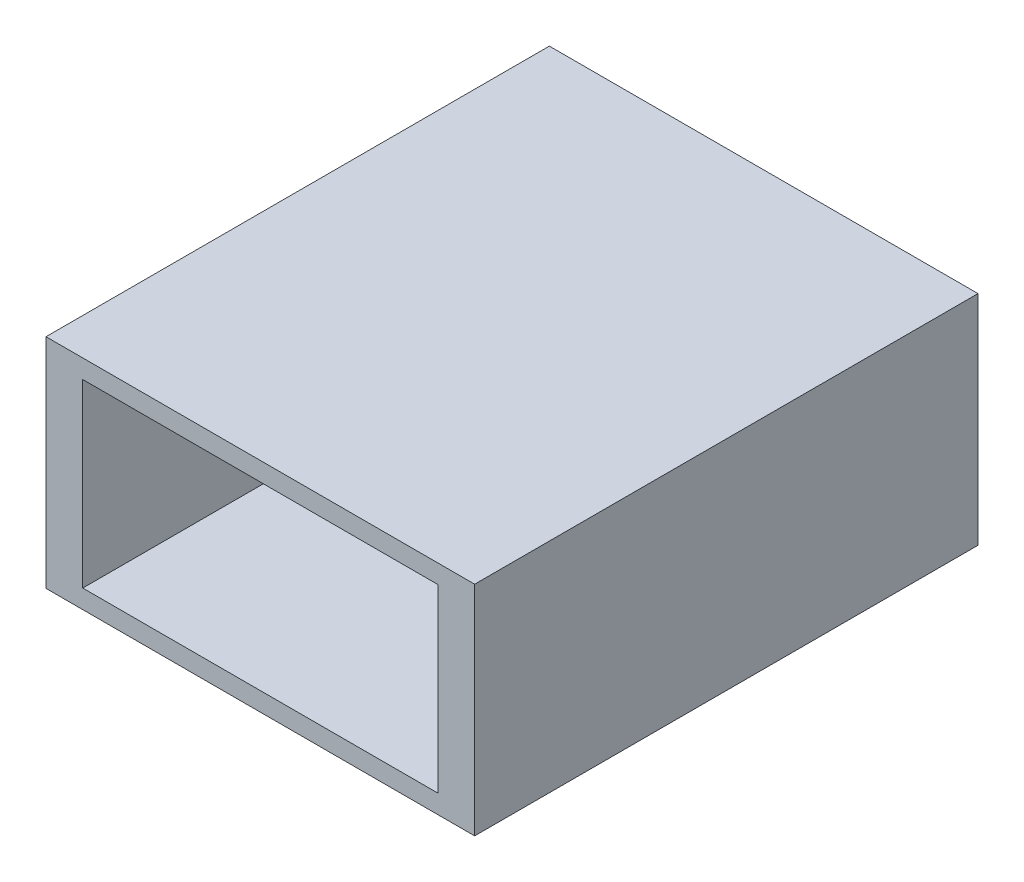
ISO-10303-21;
HEADER;
FILE_DESCRIPTION(('STEP AP214'),'2;1');
FILE_NAME('part.step','',(''),(''),'','','');
FILE_SCHEMA(('AUTOMOTIVE_DESIGN { 1 0 10303 214 1 1 1 1 }'));
ENDSEC;
DATA;
#1=APPLICATION_CONTEXT('core data for automotive mechanical design processes');
#2=APPLICATION_PROTOCOL_DEFINITION('international standard','automotive_design',2000,#1);
#3=PRODUCT_CONTEXT('',#1,'mechanical');
#4=PRODUCT('Part','Part','',(#3));
#5=PRODUCT_RELATED_PRODUCT_CATEGORY('part','',(#4));
#6=PRODUCT_DEFINITION_FORMATION('','',#4);
#7=PRODUCT_DEFINITION_CONTEXT('part definition',#1,'design');
#8=PRODUCT_DEFINITION('design','',#6,#7);
#9=PRODUCT_DEFINITION_SHAPE('','',#8);
#10=(LENGTH_UNIT() NAMED_UNIT(*) SI_UNIT(.MILLI.,.METRE.));
#11=(NAMED_UNIT(*) PLANE_ANGLE_UNIT() SI_UNIT($,.RADIAN.));
#12=(NAMED_UNIT(*) SI_UNIT($,.STERADIAN.) SOLID_ANGLE_UNIT());
#13=UNCERTAINTY_MEASURE_WITH_UNIT(LENGTH_MEASURE(1.E-05),#10,'distance_accuracy_value','');
#14=(GEOMETRIC_REPRESENTATION_CONTEXT(3) GLOBAL_UNCERTAINTY_ASSIGNED_CONTEXT((#13)) GLOBAL_UNIT_ASSIGNED_CONTEXT((#10,
#11,#12)) REPRESENTATION_CONTEXT('',''));
#15=CARTESIAN_POINT('',(0.,0.,0.));
#16=DIRECTION('',(0.,0.,1.));
#17=DIRECTION('',(1.,0.,0.));
#18=AXIS2_PLACEMENT_3D('',#15,#16,#17);
#19=CARTESIAN_POINT('',(7.24999999999999,-5.86214285714286,-31.4));
#20=DIRECTION('',(0.,0.,-1.));
#21=DIRECTION('',(-1.,0.,0.));
#22=AXIS2_PLACEMENT_3D('',#19,#20,#21);
#23=PLANE('',#22);
#24=CARTESIAN_POINT('',(0.,-2.175,-31.4));
#25=DIRECTION('',(0.,0.,-1.));
#26=DIRECTION('',(-1.,0.,0.));
#27=AXIS2_PLACEMENT_3D('',#24,#25,#26);
#28=CIRCLE('',#27,2.);
#29=CARTESIAN_POINT('',(-2.,-2.175,-31.4));
#30=VERTEX_POINT('',#29);
#31=EDGE_CURVE('E20',#30,#30,#28,.T.);
#32=ORIENTED_EDGE('',*,*,#31,.T.);
#33=EDGE_LOOP('',(#32));
#34=FACE_BOUND('',#33,.T.);
#35=DIRECTION('',(1.,0.,0.));
#36=VECTOR('',#35,1.);
#37=CARTESIAN_POINT('',(-7.24999999999999,1.51214285714286,-31.4));
#38=LINE('',#37,#36);
#39=CARTESIAN_POINT('',(-7.24999999999999,1.51214285714286,-31.4));
#40=VERTEX_POINT('',#39);
#41=CARTESIAN_POINT('',(7.24999999999999,1.51214285714286,-31.4));
#42=VERTEX_POINT('',#41);
#43=EDGE_CURVE('E93',#40,#42,#38,.T.);
#44=ORIENTED_EDGE('',*,*,#43,.F.);
#45=DIRECTION('',(0.,1.,0.));
#46=VECTOR('',#45,1.);
#47=CARTESIAN_POINT('',(-7.24999999999999,-5.86214285714286,-31.4));
#48=LINE('',#47,#46);
#49=CARTESIAN_POINT('',(-7.24999999999999,-5.86214285714286,-31.4));
#50=VERTEX_POINT('',#49);
#51=EDGE_CURVE('E84',#50,#40,#48,.T.);
#52=ORIENTED_EDGE('',*,*,#51,.F.);
#53=DIRECTION('',(1.,0.,0.));
#54=VECTOR('',#53,1.);
#55=CARTESIAN_POINT('',(-7.24999999999999,-5.86214285714286,-31.4));
#56=LINE('',#55,#54);
#57=CARTESIAN_POINT('',(7.24999999999999,-5.86214285714286,-31.4));
#58=VERTEX_POINT('',#57);
#59=EDGE_CURVE('E79',#58,#50,#56,.F.);
#60=ORIENTED_EDGE('',*,*,#59,.F.);
#61=DIRECTION('',(0.,1.,0.));
#62=VECTOR('',#61,1.);
#63=CARTESIAN_POINT('',(7.24999999999999,-5.86214285714286,-31.4));
#64=LINE('',#63,#62);
#65=EDGE_CURVE('E96',#42,#58,#64,.F.);
#66=ORIENTED_EDGE('',*,*,#65,.F.);
#67=EDGE_LOOP('',(#44,#52,#60,#66));
#68=FACE_BOUND('',#67,.T.);
#69=ADVANCED_FACE('F17',(#34,#68),#23,.F.);
#70=CARTESIAN_POINT('',(0.,-2.175,0.100999999999997));
#71=DIRECTION('',(0.,0.,-1.));
#72=DIRECTION('',(-1.,0.,0.));
#73=AXIS2_PLACEMENT_3D('',#70,#71,#72);
#74=CYLINDRICAL_SURFACE('',#73,2.);
#75=CARTESIAN_POINT('',(0.,-2.175,-32.9));
#76=DIRECTION('',(0.,0.,-1.));
#77=DIRECTION('',(-1.,0.,0.));
#78=AXIS2_PLACEMENT_3D('',#75,#76,#77);
#79=CIRCLE('',#78,2.);
#80=CARTESIAN_POINT('',(-2.,-2.175,-32.9));
#81=VERTEX_POINT('',#80);
#82=EDGE_CURVE('E107',#81,#81,#79,.F.);
#83=ORIENTED_EDGE('',*,*,#82,.F.);
#84=EDGE_LOOP('',(#83));
#85=FACE_BOUND('',#84,.T.);
#86=ORIENTED_EDGE('',*,*,#31,.F.);
#87=EDGE_LOOP('',(#86));
#88=FACE_BOUND('',#87,.T.);
#89=ADVANCED_FACE('F257',(#85,#88),#74,.F.);
#90=CARTESIAN_POINT('',(8.74999999999999,-6.625,-32.9));
#91=DIRECTION('',(0.,1.,0.));
#92=DIRECTION('',(0.,0.,1.));
#93=AXIS2_PLACEMENT_3D('',#90,#91,#92);
#94=PLANE('',#93);
#95=DIRECTION('',(0.,0.,-1.));
#96=VECTOR('',#95,1.);
#97=CARTESIAN_POINT('',(-8.74999999999999,-6.625,-32.9));
#98=LINE('',#97,#96);
#99=CARTESIAN_POINT('',(-8.74999999999999,-6.625,-12.35));
#100=VERTEX_POINT('',#99);
#101=CARTESIAN_POINT('',(-8.74999999999999,-6.625,-32.9));
#102=VERTEX_POINT('',#101);
#103=EDGE_CURVE('E121',#100,#102,#98,.T.);
#104=ORIENTED_EDGE('',*,*,#103,.T.);
#105=DIRECTION('',(-1.,0.,0.));
#106=VECTOR('',#105,1.);
#107=CARTESIAN_POINT('',(-8.74999999999999,-6.625,-32.9));
#108=LINE('',#107,#106);
#109=CARTESIAN_POINT('',(8.74999999999999,-6.625,-32.9));
#110=VERTEX_POINT('',#109);
#111=EDGE_CURVE('E110',#110,#102,#108,.T.);
#112=ORIENTED_EDGE('',*,*,#111,.F.);
#113=DIRECTION('',(0.,0.,1.));
#114=VECTOR('',#113,1.);
#115=CARTESIAN_POINT('',(8.74999999999999,-6.625,-32.9));
#116=LINE('',#115,#114);
#117=CARTESIAN_POINT('',(8.74999999999999,-6.625,-12.35));
#118=VERTEX_POINT('',#117);
#119=EDGE_CURVE('E114',#110,#118,#116,.T.);
#120=ORIENTED_EDGE('',*,*,#119,.T.);
#121=DIRECTION('',(-1.,0.,0.));
#122=VECTOR('',#121,1.);
#123=CARTESIAN_POINT('',(-8.74999999999999,-6.625,-12.35));
#124=LINE('',#123,#122);
#125=EDGE_CURVE('E148',#118,#100,#124,.T.);
#126=ORIENTED_EDGE('',*,*,#125,.T.);
#127=EDGE_LOOP('',(#104,#112,#120,#126));
#128=FACE_BOUND('',#127,.T.);
#129=ADVANCED_FACE('F153',(#128),#94,.F.);
#130=CARTESIAN_POINT('',(-7.24999999999999,1.51214285714286,-32.9));
#131=DIRECTION('',(0.,-1.,0.));
#132=DIRECTION('',(0.,0.,-1.));
#133=AXIS2_PLACEMENT_3D('',#130,#131,#132);
#134=PLANE('',#133);
#135=DIRECTION('',(0.,0.,1.));
#136=VECTOR('',#135,1.);
#137=CARTESIAN_POINT('',(7.24999999999999,1.51214285714286,-32.9));
#138=LINE('',#137,#136);
#139=CARTESIAN_POINT('',(7.24999999999999,1.51214285714286,-12.35));
#140=VERTEX_POINT('',#139);
#141=EDGE_CURVE('E129',#140,#42,#138,.F.);
#142=ORIENTED_EDGE('',*,*,#141,.F.);
#143=DIRECTION('',(-1.,0.,0.));
#144=VECTOR('',#143,1.);
#145=CARTESIAN_POINT('',(-8.74999999999999,1.51214285714286,-12.35));
#146=LINE('',#145,#144);
#147=CARTESIAN_POINT('',(-7.24999999999999,1.51214285714286,-12.35));
#148=VERTEX_POINT('',#147);
#149=EDGE_CURVE('E103',#140,#148,#146,.T.);
#150=ORIENTED_EDGE('',*,*,#149,.T.);
#151=DIRECTION('',(0.,0.,-1.));
#152=VECTOR('',#151,1.);
#153=CARTESIAN_POINT('',(-7.24999999999999,1.51214285714286,-32.9));
#154=LINE('',#153,#152);
#155=EDGE_CURVE('E89',#40,#148,#154,.F.);
#156=ORIENTED_EDGE('',*,*,#155,.F.);
#157=ORIENTED_EDGE('',*,*,#43,.T.);
#158=EDGE_LOOP('',(#142,#150,#156,#157));
#159=FACE_BOUND('',#158,.T.);
#160=ADVANCED_FACE('F102',(#159),#134,.T.);
#161=CARTESIAN_POINT('',(-7.24999999999999,-5.86214285714286,-32.9));
#162=DIRECTION('',(1.,0.,0.));
#163=DIRECTION('',(0.,0.,-1.));
#164=AXIS2_PLACEMENT_3D('',#161,#162,#163);
#165=PLANE('',#164);
#166=ORIENTED_EDGE('',*,*,#155,.T.);
#167=DIRECTION('',(0.,1.,0.));
#168=VECTOR('',#167,1.);
#169=CARTESIAN_POINT('',(-7.24999999999999,-6.625,-12.35));
#170=LINE('',#169,#168);
#171=CARTESIAN_POINT('',(-7.24999999999999,-5.86214285714286,-12.35));
#172=VERTEX_POINT('',#171);
#173=EDGE_CURVE('E137',#148,#172,#170,.F.);
#174=ORIENTED_EDGE('',*,*,#173,.T.);
#175=DIRECTION('',(0.,0.,1.));
#176=VECTOR('',#175,1.);
#177=CARTESIAN_POINT('',(-7.24999999999999,-5.86214285714286,-32.9));
#178=LINE('',#177,#176);
#179=EDGE_CURVE('E91',#50,#172,#178,.T.);
#180=ORIENTED_EDGE('',*,*,#179,.F.);
#181=ORIENTED_EDGE('',*,*,#51,.T.);
#182=EDGE_LOOP('',(#166,#174,#180,#181));
#183=FACE_BOUND('',#182,.T.);
#184=ADVANCED_FACE('F86',(#183),#165,.T.);
#185=CARTESIAN_POINT('',(-7.24999999999999,-5.86214285714286,-32.9));
#186=DIRECTION('',(0.,1.,0.));
#187=DIRECTION('',(0.,0.,1.));
#188=AXIS2_PLACEMENT_3D('',#185,#186,#187);
#189=PLANE('',#188);
#190=ORIENTED_EDGE('',*,*,#179,.T.);
#191=DIRECTION('',(-1.,0.,0.));
#192=VECTOR('',#191,1.);
#193=CARTESIAN_POINT('',(-8.74999999999999,-5.86214285714286,-12.35));
#194=LINE('',#193,#192);
#195=CARTESIAN_POINT('',(7.24999999999999,-5.86214285714286,-12.35));
#196=VERTEX_POINT('',#195);
#197=EDGE_CURVE('E133',#172,#196,#194,.F.);
#198=ORIENTED_EDGE('',*,*,#197,.T.);
#199=DIRECTION('',(0.,0.,1.));
#200=VECTOR('',#199,1.);
#201=CARTESIAN_POINT('',(7.24999999999999,-5.86214285714286,-32.9));
#202=LINE('',#201,#200);
#203=EDGE_CURVE('E126',#58,#196,#202,.T.);
#204=ORIENTED_EDGE('',*,*,#203,.F.);
#205=ORIENTED_EDGE('',*,*,#59,.T.);
#206=EDGE_LOOP('',(#190,#198,#204,#205));
#207=FACE_BOUND('',#206,.T.);
#208=ADVANCED_FACE('F132',(#207),#189,.T.);
#209=CARTESIAN_POINT('',(7.24999999999999,-5.86214285714286,-32.9));
#210=DIRECTION('',(-1.,0.,0.));
#211=DIRECTION('',(0.,0.,1.));
#212=AXIS2_PLACEMENT_3D('',#209,#210,#211);
#213=PLANE('',#212);
#214=ORIENTED_EDGE('',*,*,#203,.T.);
#215=DIRECTION('',(0.,1.,0.));
#216=VECTOR('',#215,1.);
#217=CARTESIAN_POINT('',(7.24999999999999,-6.625,-12.35));
#218=LINE('',#217,#216);
#219=EDGE_CURVE('E139',#196,#140,#218,.T.);
#220=ORIENTED_EDGE('',*,*,#219,.T.);
#221=ORIENTED_EDGE('',*,*,#141,.T.);
#222=ORIENTED_EDGE('',*,*,#65,.T.);
#223=EDGE_LOOP('',(#214,#220,#221,#222));
#224=FACE_BOUND('',#223,.T.);
#225=ADVANCED_FACE('F169',(#224),#213,.T.);
#226=CARTESIAN_POINT('',(-8.74999999999999,2.275,-32.9));
#227=DIRECTION('',(1.,0.,0.));
#228=DIRECTION('',(0.,0.,-1.));
#229=AXIS2_PLACEMENT_3D('',#226,#227,#228);
#230=PLANE('',#229);
#231=DIRECTION('',(0.,0.,-1.));
#232=VECTOR('',#231,1.);
#233=CARTESIAN_POINT('',(-8.74999999999999,2.275,-32.9));
#234=LINE('',#233,#232);
#235=CARTESIAN_POINT('',(-8.74999999999999,2.275,-12.35));
#236=VERTEX_POINT('',#235);
#237=CARTESIAN_POINT('',(-8.74999999999999,2.275,-32.9));
#238=VERTEX_POINT('',#237);
#239=EDGE_CURVE('E164',#236,#238,#234,.T.);
#240=ORIENTED_EDGE('',*,*,#239,.T.);
#241=DIRECTION('',(0.,1.,0.));
#242=VECTOR('',#241,1.);
#243=CARTESIAN_POINT('',(-8.74999999999999,-6.625,-32.9));
#244=LINE('',#243,#242);
#245=EDGE_CURVE('E117',#102,#238,#244,.T.);
#246=ORIENTED_EDGE('',*,*,#245,.F.);
#247=ORIENTED_EDGE('',*,*,#103,.F.);
#248=DIRECTION('',(0.,1.,0.));
#249=VECTOR('',#248,1.);
#250=CARTESIAN_POINT('',(-8.74999999999999,-6.625,-12.35));
#251=LINE('',#250,#249);
#252=EDGE_CURVE('E142',#100,#236,#251,.T.);
#253=ORIENTED_EDGE('',*,*,#252,.T.);
#254=EDGE_LOOP('',(#240,#246,#247,#253));
#255=FACE_BOUND('',#254,.T.);
#256=ADVANCED_FACE('F171',(#255),#230,.F.);
#257=CARTESIAN_POINT('',(-8.74999999999999,-6.625,-32.9));
#258=DIRECTION('',(0.,0.,-1.));
#259=DIRECTION('',(-1.,0.,0.));
#260=AXIS2_PLACEMENT_3D('',#257,#258,#259);
#261=PLANE('',#260);
#262=ORIENTED_EDGE('',*,*,#82,.T.);
#263=EDGE_LOOP('',(#262));
#264=FACE_BOUND('',#263,.T.);
#265=DIRECTION('',(0.,1.,0.));
#266=VECTOR('',#265,1.);
#267=CARTESIAN_POINT('',(8.74999999999999,2.275,-32.9));
#268=LINE('',#267,#266);
#269=CARTESIAN_POINT('',(8.74999999999999,2.275,-32.9));
#270=VERTEX_POINT('',#269);
#271=EDGE_CURVE('E109',#270,#110,#268,.F.);
#272=ORIENTED_EDGE('',*,*,#271,.T.);
#273=ORIENTED_EDGE('',*,*,#111,.T.);
#274=ORIENTED_EDGE('',*,*,#245,.T.);
#275=DIRECTION('',(1.,0.,0.));
#276=VECTOR('',#275,1.);
#277=CARTESIAN_POINT('',(8.74999999999999,2.275,-32.9));
#278=LINE('',#277,#276);
#279=EDGE_CURVE('E162',#238,#270,#278,.T.);
#280=ORIENTED_EDGE('',*,*,#279,.T.);
#281=EDGE_LOOP('',(#272,#273,#274,#280));
#282=FACE_BOUND('',#281,.T.);
#283=ADVANCED_FACE('F178',(#264,#282),#261,.T.);
#284=CARTESIAN_POINT('',(8.74999999999999,2.275,-32.9));
#285=DIRECTION('',(-1.,0.,0.));
#286=DIRECTION('',(0.,0.,1.));
#287=AXIS2_PLACEMENT_3D('',#284,#285,#286);
#288=PLANE('',#287);
#289=ORIENTED_EDGE('',*,*,#119,.F.);
#290=ORIENTED_EDGE('',*,*,#271,.F.);
#291=DIRECTION('',(0.,0.,-1.));
#292=VECTOR('',#291,1.);
#293=CARTESIAN_POINT('',(8.74999999999999,2.275,-32.9));
#294=LINE('',#293,#292);
#295=CARTESIAN_POINT('',(8.74999999999999,2.275,-12.35));
#296=VERTEX_POINT('',#295);
#297=EDGE_CURVE('E26',#270,#296,#294,.F.);
#298=ORIENTED_EDGE('',*,*,#297,.T.);
#299=DIRECTION('',(0.,1.,0.));
#300=VECTOR('',#299,1.);
#301=CARTESIAN_POINT('',(8.74999999999999,-6.625,-12.35));
#302=LINE('',#301,#300);
#303=EDGE_CURVE('E34',#296,#118,#302,.F.);
#304=ORIENTED_EDGE('',*,*,#303,.T.);
#305=EDGE_LOOP('',(#289,#290,#298,#304));
#306=FACE_BOUND('',#305,.T.);
#307=ADVANCED_FACE('F157',(#306),#288,.F.);
#308=CARTESIAN_POINT('',(-8.74999999999999,-6.625,-12.35));
#309=DIRECTION('',(0.,0.,-1.));
#310=DIRECTION('',(-1.,0.,0.));
#311=AXIS2_PLACEMENT_3D('',#308,#309,#310);
#312=PLANE('',#311);
#313=ORIENTED_EDGE('',*,*,#197,.F.);
#314=ORIENTED_EDGE('',*,*,#173,.F.);
#315=ORIENTED_EDGE('',*,*,#149,.F.);
#316=ORIENTED_EDGE('',*,*,#219,.F.);
#317=EDGE_LOOP('',(#313,#314,#315,#316));
#318=FACE_BOUND('',#317,.T.);
#319=ORIENTED_EDGE('',*,*,#125,.F.);
#320=ORIENTED_EDGE('',*,*,#303,.F.);
#321=DIRECTION('',(1.,0.,0.));
#322=VECTOR('',#321,1.);
#323=CARTESIAN_POINT('',(8.74999999999999,2.275,-12.35));
#324=LINE('',#323,#322);
#325=EDGE_CURVE('E11',#296,#236,#324,.F.);
#326=ORIENTED_EDGE('',*,*,#325,.T.);
#327=ORIENTED_EDGE('',*,*,#252,.F.);
#328=EDGE_LOOP('',(#319,#320,#326,#327));
#329=FACE_BOUND('',#328,.T.);
#330=ADVANCED_FACE('F136',(#318,#329),#312,.F.);
#331=CARTESIAN_POINT('',(8.74999999999999,2.275,-32.9));
#332=DIRECTION('',(0.,-1.,0.));
#333=DIRECTION('',(0.,0.,-1.));
#334=AXIS2_PLACEMENT_3D('',#331,#332,#333);
#335=PLANE('',#334);
#336=ORIENTED_EDGE('',*,*,#297,.F.);
#337=ORIENTED_EDGE('',*,*,#279,.F.);
#338=ORIENTED_EDGE('',*,*,#239,.F.);
#339=ORIENTED_EDGE('',*,*,#325,.F.);
#340=EDGE_LOOP('',(#336,#337,#338,#339));
#341=FACE_BOUND('',#340,.T.);
#342=ADVANCED_FACE('F182',(#341),#335,.F.);
#343=CLOSED_SHELL('',(#69,#89,#129,#160,#184,#208,#225,#256,#283,#307,#330,#342));
#344=MANIFOLD_SOLID_BREP('B1',#343);
#345=ADVANCED_BREP_SHAPE_REPRESENTATION('',(#18,#344),#14);
#346=SHAPE_DEFINITION_REPRESENTATION(#9,#345);
ENDSEC;
END-ISO-10303-21;
